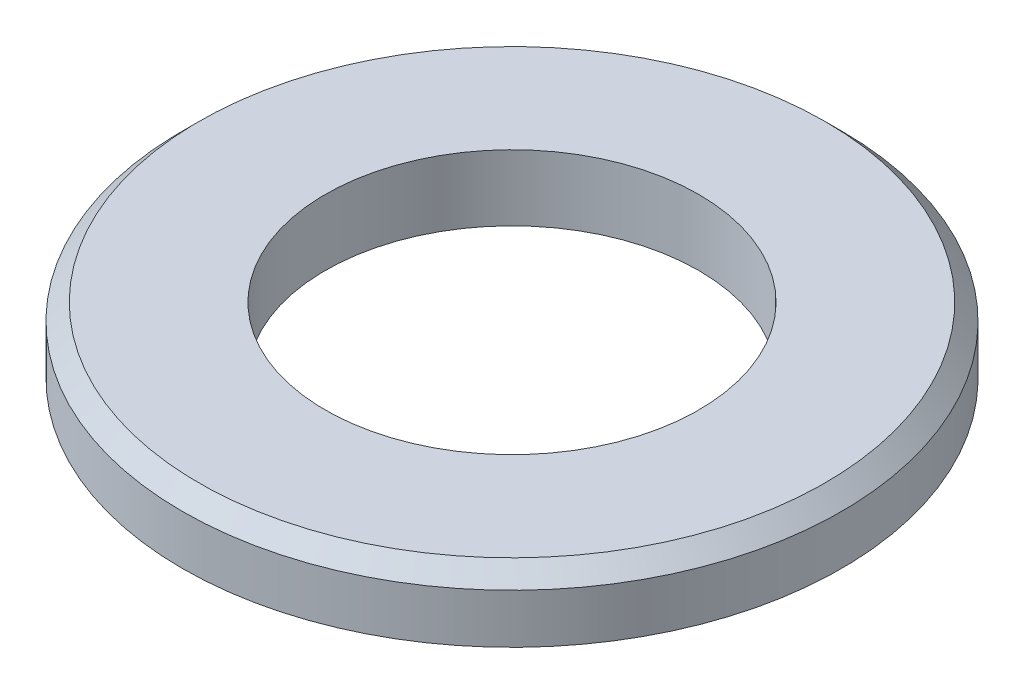
ISO-10303-21;
HEADER;
FILE_DESCRIPTION(('STEP AP214'),'2;1');
FILE_NAME('part.step','',(''),(''),'','','');
FILE_SCHEMA(('AUTOMOTIVE_DESIGN { 1 0 10303 214 1 1 1 1 }'));
ENDSEC;
DATA;
#1=APPLICATION_CONTEXT('core data for automotive mechanical design processes');
#2=APPLICATION_PROTOCOL_DEFINITION('international standard','automotive_design',2000,#1);
#3=PRODUCT_CONTEXT('',#1,'mechanical');
#4=PRODUCT('Part','Part','',(#3));
#5=PRODUCT_RELATED_PRODUCT_CATEGORY('part','',(#4));
#6=PRODUCT_DEFINITION_FORMATION('','',#4);
#7=PRODUCT_DEFINITION_CONTEXT('part definition',#1,'design');
#8=PRODUCT_DEFINITION('design','',#6,#7);
#9=PRODUCT_DEFINITION_SHAPE('','',#8);
#10=(LENGTH_UNIT() NAMED_UNIT(*) SI_UNIT(.MILLI.,.METRE.));
#11=(NAMED_UNIT(*) PLANE_ANGLE_UNIT() SI_UNIT($,.RADIAN.));
#12=(NAMED_UNIT(*) SI_UNIT($,.STERADIAN.) SOLID_ANGLE_UNIT());
#13=UNCERTAINTY_MEASURE_WITH_UNIT(LENGTH_MEASURE(1.E-05),#10,'distance_accuracy_value','');
#14=(GEOMETRIC_REPRESENTATION_CONTEXT(3) GLOBAL_UNCERTAINTY_ASSIGNED_CONTEXT((#13)) GLOBAL_UNIT_ASSIGNED_CONTEXT((#10,
#11,#12)) REPRESENTATION_CONTEXT('',''));
#15=CARTESIAN_POINT('',(0.,0.,0.));
#16=DIRECTION('',(0.,0.,1.));
#17=DIRECTION('',(1.,0.,0.));
#18=AXIS2_PLACEMENT_3D('',#15,#16,#17);
#19=CARTESIAN_POINT('',(-8.5,11.6445070422535,0.));
#20=DIRECTION('',(0.,-1.,0.));
#21=DIRECTION('',(0.,0.,-1.));
#22=AXIS2_PLACEMENT_3D('',#19,#20,#21);
#23=PLANE('',#22);
#24=CARTESIAN_POINT('',(0.,11.6445070422535,0.));
#25=DIRECTION('',(0.,-1.,0.));
#26=DIRECTION('',(0.,0.,-1.));
#27=AXIS2_PLACEMENT_3D('',#24,#25,#26);
#28=CIRCLE('',#27,8.5);
#29=CARTESIAN_POINT('',(0.,11.6445070422535,-8.5));
#30=VERTEX_POINT('',#29);
#31=EDGE_CURVE('E29',#30,#30,#28,.T.);
#32=ORIENTED_EDGE('',*,*,#31,.T.);
#33=EDGE_LOOP('',(#32));
#34=FACE_BOUND('',#33,.T.);
#35=CARTESIAN_POINT('',(0.,11.6445070422535,0.));
#36=DIRECTION('',(0.,-1.,0.));
#37=DIRECTION('',(0.,0.,-1.));
#38=AXIS2_PLACEMENT_3D('',#35,#36,#37);
#39=CIRCLE('',#38,14.25);
#40=CARTESIAN_POINT('',(0.,11.6445070422535,-14.25));
#41=VERTEX_POINT('',#40);
#42=EDGE_CURVE('E17',#41,#41,#39,.T.);
#43=ORIENTED_EDGE('',*,*,#42,.F.);
#44=EDGE_LOOP('',(#43));
#45=FACE_BOUND('',#44,.T.);
#46=ADVANCED_FACE('F14',(#34,#45),#23,.F.);
#47=CARTESIAN_POINT('',(0.,10.8945070422535,0.));
#48=DIRECTION('',(0.,-1.,0.));
#49=DIRECTION('',(0.,0.,-1.));
#50=AXIS2_PLACEMENT_3D('',#47,#48,#49);
#51=CONICAL_SURFACE('',#50,15.,0.78539816339745);
#52=CARTESIAN_POINT('',(0.,10.8945070422535,0.));
#53=DIRECTION('',(0.,-1.,0.));
#54=DIRECTION('',(0.,0.,-1.));
#55=AXIS2_PLACEMENT_3D('',#52,#53,#54);
#56=CIRCLE('',#55,15.);
#57=CARTESIAN_POINT('',(0.,10.8945070422535,-15.));
#58=VERTEX_POINT('',#57);
#59=EDGE_CURVE('E26',#58,#58,#56,.T.);
#60=ORIENTED_EDGE('',*,*,#59,.F.);
#61=EDGE_LOOP('',(#60));
#62=FACE_BOUND('',#61,.T.);
#63=ORIENTED_EDGE('',*,*,#42,.T.);
#64=EDGE_LOOP('',(#63));
#65=FACE_BOUND('',#64,.T.);
#66=ADVANCED_FACE('F37',(#62,#65),#51,.T.);
#67=CARTESIAN_POINT('',(0.,0.,0.));
#68=DIRECTION('',(0.,-1.,0.));
#69=DIRECTION('',(0.,0.,-1.));
#70=AXIS2_PLACEMENT_3D('',#67,#68,#69);
#71=CYLINDRICAL_SURFACE('',#70,8.5);
#72=ORIENTED_EDGE('',*,*,#31,.F.);
#73=EDGE_LOOP('',(#72));
#74=FACE_BOUND('',#73,.T.);
#75=CARTESIAN_POINT('',(0.,8.64450704225353,0.));
#76=DIRECTION('',(0.,-1.,0.));
#77=DIRECTION('',(0.,0.,-1.));
#78=AXIS2_PLACEMENT_3D('',#75,#76,#77);
#79=CIRCLE('',#78,8.5);
#80=CARTESIAN_POINT('',(0.,8.64450704225353,-8.5));
#81=VERTEX_POINT('',#80);
#82=EDGE_CURVE('E21',#81,#81,#79,.T.);
#83=ORIENTED_EDGE('',*,*,#82,.T.);
#84=EDGE_LOOP('',(#83));
#85=FACE_BOUND('',#84,.T.);
#86=ADVANCED_FACE('F44',(#74,#85),#71,.F.);
#87=CARTESIAN_POINT('',(0.,0.,0.));
#88=DIRECTION('',(0.,-1.,0.));
#89=DIRECTION('',(0.,0.,-1.));
#90=AXIS2_PLACEMENT_3D('',#87,#88,#89);
#91=CYLINDRICAL_SURFACE('',#90,15.);
#92=CARTESIAN_POINT('',(0.,8.64450704225353,0.));
#93=DIRECTION('',(0.,-1.,0.));
#94=DIRECTION('',(0.,0.,-1.));
#95=AXIS2_PLACEMENT_3D('',#92,#93,#94);
#96=CIRCLE('',#95,15.);
#97=CARTESIAN_POINT('',(0.,8.64450704225353,-15.));
#98=VERTEX_POINT('',#97);
#99=EDGE_CURVE('E10',#98,#98,#96,.F.);
#100=ORIENTED_EDGE('',*,*,#99,.T.);
#101=EDGE_LOOP('',(#100));
#102=FACE_BOUND('',#101,.T.);
#103=ORIENTED_EDGE('',*,*,#59,.T.);
#104=EDGE_LOOP('',(#103));
#105=FACE_BOUND('',#104,.T.);
#106=ADVANCED_FACE('F48',(#102,#105),#91,.T.);
#107=CARTESIAN_POINT('',(-8.5,8.64450704225353,0.));
#108=DIRECTION('',(0.,1.,0.));
#109=DIRECTION('',(0.,0.,1.));
#110=AXIS2_PLACEMENT_3D('',#107,#108,#109);
#111=PLANE('',#110);
#112=ORIENTED_EDGE('',*,*,#99,.F.);
#113=EDGE_LOOP('',(#112));
#114=FACE_BOUND('',#113,.T.);
#115=ORIENTED_EDGE('',*,*,#82,.F.);
#116=EDGE_LOOP('',(#115));
#117=FACE_BOUND('',#116,.T.);
#118=ADVANCED_FACE('F46',(#114,#117),#111,.F.);
#119=CLOSED_SHELL('',(#46,#66,#86,#106,#118));
#120=MANIFOLD_SOLID_BREP('B1',#119);
#121=ADVANCED_BREP_SHAPE_REPRESENTATION('',(#18,#120),#14);
#122=SHAPE_DEFINITION_REPRESENTATION(#9,#121);
ENDSEC;
END-ISO-10303-21;
